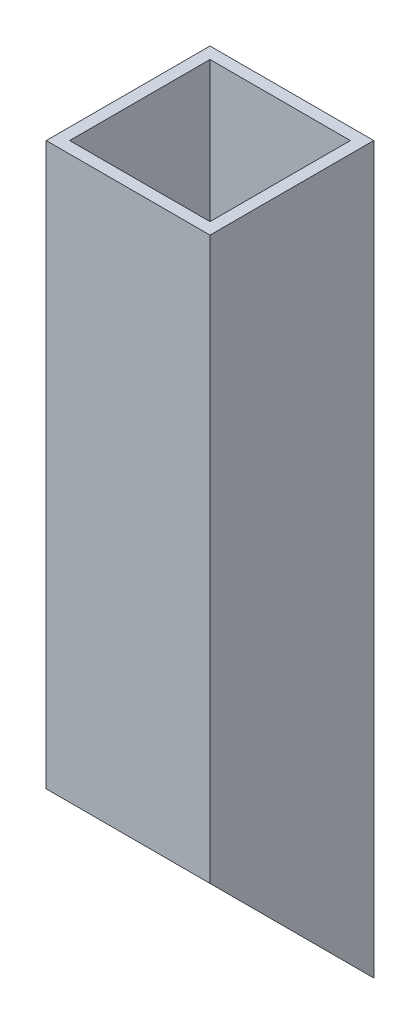
ISO-10303-21;
HEADER;
FILE_DESCRIPTION(('STEP AP214'),'2;1');
FILE_NAME('part.step','',(''),(''),'','','');
FILE_SCHEMA(('AUTOMOTIVE_DESIGN { 1 0 10303 214 1 1 1 1 }'));
ENDSEC;
DATA;
#1=APPLICATION_CONTEXT('core data for automotive mechanical design processes');
#2=APPLICATION_PROTOCOL_DEFINITION('international standard','automotive_design',2000,#1);
#3=PRODUCT_CONTEXT('',#1,'mechanical');
#4=PRODUCT('Part','Part','',(#3));
#5=PRODUCT_RELATED_PRODUCT_CATEGORY('part','',(#4));
#6=PRODUCT_DEFINITION_FORMATION('','',#4);
#7=PRODUCT_DEFINITION_CONTEXT('part definition',#1,'design');
#8=PRODUCT_DEFINITION('design','',#6,#7);
#9=PRODUCT_DEFINITION_SHAPE('','',#8);
#10=(LENGTH_UNIT() NAMED_UNIT(*) SI_UNIT(.MILLI.,.METRE.));
#11=(NAMED_UNIT(*) PLANE_ANGLE_UNIT() SI_UNIT($,.RADIAN.));
#12=(NAMED_UNIT(*) SI_UNIT($,.STERADIAN.) SOLID_ANGLE_UNIT());
#13=UNCERTAINTY_MEASURE_WITH_UNIT(LENGTH_MEASURE(1.E-05),#10,'distance_accuracy_value','');
#14=(GEOMETRIC_REPRESENTATION_CONTEXT(3) GLOBAL_UNCERTAINTY_ASSIGNED_CONTEXT((#13)) GLOBAL_UNIT_ASSIGNED_CONTEXT((#10,
#11,#12)) REPRESENTATION_CONTEXT('',''));
#15=CARTESIAN_POINT('',(0.,0.,0.));
#16=DIRECTION('',(0.,0.,1.));
#17=DIRECTION('',(1.,0.,0.));
#18=AXIS2_PLACEMENT_3D('',#15,#16,#17);
#19=CARTESIAN_POINT('',(0.,196.85,0.));
#20=DIRECTION('',(0.,-1.,0.));
#21=DIRECTION('',(0.,0.,-1.));
#22=AXIS2_PLACEMENT_3D('',#19,#20,#21);
#23=PLANE('',#22);
#24=DIRECTION('',(0.,0.,1.));
#25=VECTOR('',#24,1.);
#26=CARTESIAN_POINT('',(0.,196.85,0.));
#27=LINE('',#26,#25);
#28=CARTESIAN_POINT('',(0.,196.85,-44.45));
#29=VERTEX_POINT('',#28);
#30=CARTESIAN_POINT('',(0.,196.85,0.));
#31=VERTEX_POINT('',#30);
#32=EDGE_CURVE('E120',#29,#31,#27,.T.);
#33=ORIENTED_EDGE('',*,*,#32,.T.);
#34=DIRECTION('',(1.,0.,0.));
#35=VECTOR('',#34,1.);
#36=CARTESIAN_POINT('',(0.,196.85,0.));
#37=LINE('',#36,#35);
#38=CARTESIAN_POINT('',(44.45,196.85,0.));
#39=VERTEX_POINT('',#38);
#40=EDGE_CURVE('E126',#31,#39,#37,.T.);
#41=ORIENTED_EDGE('',*,*,#40,.T.);
#42=DIRECTION('',(0.,0.,-1.));
#43=VECTOR('',#42,1.);
#44=CARTESIAN_POINT('',(44.45,196.85,0.));
#45=LINE('',#44,#43);
#46=CARTESIAN_POINT('',(44.45,196.85,-44.45));
#47=VERTEX_POINT('',#46);
#48=EDGE_CURVE('E123',#39,#47,#45,.T.);
#49=ORIENTED_EDGE('',*,*,#48,.T.);
#50=DIRECTION('',(-1.,0.,0.));
#51=VECTOR('',#50,1.);
#52=CARTESIAN_POINT('',(0.,196.85,-44.45));
#53=LINE('',#52,#51);
#54=EDGE_CURVE('E117',#47,#29,#53,.T.);
#55=ORIENTED_EDGE('',*,*,#54,.T.);
#56=EDGE_LOOP('',(#33,#41,#49,#55));
#57=FACE_BOUND('',#56,.T.);
#58=DIRECTION('',(1.,0.,0.));
#59=VECTOR('',#58,1.);
#60=CARTESIAN_POINT('',(3.175,196.85,-3.175));
#61=LINE('',#60,#59);
#62=CARTESIAN_POINT('',(3.175,196.85,-3.175));
#63=VERTEX_POINT('',#62);
#64=CARTESIAN_POINT('',(41.275,196.85,-3.175));
#65=VERTEX_POINT('',#64);
#66=EDGE_CURVE('E88',#63,#65,#61,.T.);
#67=ORIENTED_EDGE('',*,*,#66,.F.);
#68=DIRECTION('',(0.,0.,1.));
#69=VECTOR('',#68,1.);
#70=CARTESIAN_POINT('',(3.175,196.85,-3.175));
#71=LINE('',#70,#69);
#72=CARTESIAN_POINT('',(3.175,196.85,-41.275));
#73=VERTEX_POINT('',#72);
#74=EDGE_CURVE('E136',#73,#63,#71,.T.);
#75=ORIENTED_EDGE('',*,*,#74,.F.);
#76=DIRECTION('',(-1.,0.,0.));
#77=VECTOR('',#76,1.);
#78=CARTESIAN_POINT('',(3.175,196.85,-41.275));
#79=LINE('',#78,#77);
#80=CARTESIAN_POINT('',(41.275,196.85,-41.275));
#81=VERTEX_POINT('',#80);
#82=EDGE_CURVE('E139',#81,#73,#79,.T.);
#83=ORIENTED_EDGE('',*,*,#82,.F.);
#84=DIRECTION('',(0.,0.,-1.));
#85=VECTOR('',#84,1.);
#86=CARTESIAN_POINT('',(41.275,196.85,-3.175));
#87=LINE('',#86,#85);
#88=EDGE_CURVE('E98',#65,#81,#87,.T.);
#89=ORIENTED_EDGE('',*,*,#88,.F.);
#90=EDGE_LOOP('',(#67,#75,#83,#89));
#91=FACE_BOUND('',#90,.T.);
#92=ADVANCED_FACE('F33',(#57,#91),#23,.F.);
#93=CARTESIAN_POINT('',(0.,196.85,0.));
#94=DIRECTION('',(1.,0.,0.));
#95=DIRECTION('',(0.,0.,-1.));
#96=AXIS2_PLACEMENT_3D('',#93,#94,#95);
#97=PLANE('',#96);
#98=DIRECTION('',(0.,-1.,0.));
#99=VECTOR('',#98,1.);
#100=CARTESIAN_POINT('',(0.,196.85,-44.45));
#101=LINE('',#100,#99);
#102=CARTESIAN_POINT('',(0.,0.,-44.45));
#103=VERTEX_POINT('',#102);
#104=EDGE_CURVE('E115',#29,#103,#101,.T.);
#105=ORIENTED_EDGE('',*,*,#104,.T.);
#106=DIRECTION('',(0.,0.707106781186546,0.707106781186549));
#107=VECTOR('',#106,1.);
#108=CARTESIAN_POINT('',(0.,44.45,0.));
#109=LINE('',#108,#107);
#110=CARTESIAN_POINT('',(0.,44.45,0.));
#111=VERTEX_POINT('',#110);
#112=EDGE_CURVE('E11',#103,#111,#109,.T.);
#113=ORIENTED_EDGE('',*,*,#112,.T.);
#114=DIRECTION('',(0.,-1.,0.));
#115=VECTOR('',#114,1.);
#116=CARTESIAN_POINT('',(0.,196.85,0.));
#117=LINE('',#116,#115);
#118=EDGE_CURVE('E107',#31,#111,#117,.T.);
#119=ORIENTED_EDGE('',*,*,#118,.F.);
#120=ORIENTED_EDGE('',*,*,#32,.F.);
#121=EDGE_LOOP('',(#105,#113,#119,#120));
#122=FACE_BOUND('',#121,.T.);
#123=ADVANCED_FACE('F173',(#122),#97,.F.);
#124=CARTESIAN_POINT('',(0.,196.85,0.));
#125=DIRECTION('',(0.,0.,-1.));
#126=DIRECTION('',(-1.,0.,0.));
#127=AXIS2_PLACEMENT_3D('',#124,#125,#126);
#128=PLANE('',#127);
#129=ORIENTED_EDGE('',*,*,#118,.T.);
#130=DIRECTION('',(1.,0.,0.));
#131=VECTOR('',#130,1.);
#132=CARTESIAN_POINT('',(44.45,44.45,0.));
#133=LINE('',#132,#131);
#134=CARTESIAN_POINT('',(44.45,44.45,0.));
#135=VERTEX_POINT('',#134);
#136=EDGE_CURVE('E104',#111,#135,#133,.T.);
#137=ORIENTED_EDGE('',*,*,#136,.T.);
#138=DIRECTION('',(0.,-1.,0.));
#139=VECTOR('',#138,1.);
#140=CARTESIAN_POINT('',(44.45,196.85,0.));
#141=LINE('',#140,#139);
#142=EDGE_CURVE('E109',#39,#135,#141,.T.);
#143=ORIENTED_EDGE('',*,*,#142,.F.);
#144=ORIENTED_EDGE('',*,*,#40,.F.);
#145=EDGE_LOOP('',(#129,#137,#143,#144));
#146=FACE_BOUND('',#145,.T.);
#147=ADVANCED_FACE('F177',(#146),#128,.F.);
#148=CARTESIAN_POINT('',(44.45,196.85,0.));
#149=DIRECTION('',(-1.,0.,0.));
#150=DIRECTION('',(0.,0.,1.));
#151=AXIS2_PLACEMENT_3D('',#148,#149,#150);
#152=PLANE('',#151);
#153=ORIENTED_EDGE('',*,*,#142,.T.);
#154=DIRECTION('',(0.,-0.707106781186546,-0.707106781186549));
#155=VECTOR('',#154,1.);
#156=CARTESIAN_POINT('',(44.45,44.45,0.));
#157=LINE('',#156,#155);
#158=CARTESIAN_POINT('',(44.45,0.,-44.45));
#159=VERTEX_POINT('',#158);
#160=EDGE_CURVE('E43',#135,#159,#157,.T.);
#161=ORIENTED_EDGE('',*,*,#160,.T.);
#162=DIRECTION('',(0.,-1.,0.));
#163=VECTOR('',#162,1.);
#164=CARTESIAN_POINT('',(44.45,196.85,-44.45));
#165=LINE('',#164,#163);
#166=EDGE_CURVE('E112',#47,#159,#165,.T.);
#167=ORIENTED_EDGE('',*,*,#166,.F.);
#168=ORIENTED_EDGE('',*,*,#48,.F.);
#169=EDGE_LOOP('',(#153,#161,#167,#168));
#170=FACE_BOUND('',#169,.T.);
#171=ADVANCED_FACE('F180',(#170),#152,.F.);
#172=CARTESIAN_POINT('',(0.,196.85,-44.45));
#173=DIRECTION('',(0.,0.,1.));
#174=DIRECTION('',(1.,0.,0.));
#175=AXIS2_PLACEMENT_3D('',#172,#173,#174);
#176=PLANE('',#175);
#177=DIRECTION('',(-1.,0.,0.));
#178=VECTOR('',#177,1.);
#179=CARTESIAN_POINT('',(0.,0.,-44.45));
#180=LINE('',#179,#178);
#181=EDGE_CURVE('E89',#159,#103,#180,.T.);
#182=ORIENTED_EDGE('',*,*,#181,.T.);
#183=ORIENTED_EDGE('',*,*,#104,.F.);
#184=ORIENTED_EDGE('',*,*,#54,.F.);
#185=ORIENTED_EDGE('',*,*,#166,.T.);
#186=EDGE_LOOP('',(#182,#183,#184,#185));
#187=FACE_BOUND('',#186,.T.);
#188=ADVANCED_FACE('F168',(#187),#176,.F.);
#189=CARTESIAN_POINT('',(3.175,196.85,-3.175));
#190=DIRECTION('',(0.,0.,-1.));
#191=DIRECTION('',(-1.,0.,0.));
#192=AXIS2_PLACEMENT_3D('',#189,#190,#191);
#193=PLANE('',#192);
#194=DIRECTION('',(1.,0.,0.));
#195=VECTOR('',#194,1.);
#196=CARTESIAN_POINT('',(0.,41.275,-3.175));
#197=LINE('',#196,#195);
#198=CARTESIAN_POINT('',(3.175,41.275,-3.175));
#199=VERTEX_POINT('',#198);
#200=CARTESIAN_POINT('',(41.275,41.275,-3.175));
#201=VERTEX_POINT('',#200);
#202=EDGE_CURVE('E37',#199,#201,#197,.T.);
#203=ORIENTED_EDGE('',*,*,#202,.F.);
#204=DIRECTION('',(0.,-1.,0.));
#205=VECTOR('',#204,1.);
#206=CARTESIAN_POINT('',(3.175,196.85,-3.175));
#207=LINE('',#206,#205);
#208=EDGE_CURVE('E134',#63,#199,#207,.T.);
#209=ORIENTED_EDGE('',*,*,#208,.F.);
#210=ORIENTED_EDGE('',*,*,#66,.T.);
#211=DIRECTION('',(0.,-1.,0.));
#212=VECTOR('',#211,1.);
#213=CARTESIAN_POINT('',(41.275,196.85,-3.175));
#214=LINE('',#213,#212);
#215=EDGE_CURVE('E72',#65,#201,#214,.T.);
#216=ORIENTED_EDGE('',*,*,#215,.T.);
#217=EDGE_LOOP('',(#203,#209,#210,#216));
#218=FACE_BOUND('',#217,.T.);
#219=ADVANCED_FACE('F84',(#218),#193,.T.);
#220=CARTESIAN_POINT('',(41.275,196.85,-3.175));
#221=DIRECTION('',(-1.,0.,0.));
#222=DIRECTION('',(0.,0.,1.));
#223=AXIS2_PLACEMENT_3D('',#220,#221,#222);
#224=PLANE('',#223);
#225=DIRECTION('',(0.,-0.707106781186546,-0.707106781186549));
#226=VECTOR('',#225,1.);
#227=CARTESIAN_POINT('',(41.275,44.45,0.));
#228=LINE('',#227,#226);
#229=CARTESIAN_POINT('',(41.275,3.17500000000018,-41.275));
#230=VERTEX_POINT('',#229);
#231=EDGE_CURVE('E68',#201,#230,#228,.T.);
#232=ORIENTED_EDGE('',*,*,#231,.F.);
#233=ORIENTED_EDGE('',*,*,#215,.F.);
#234=ORIENTED_EDGE('',*,*,#88,.T.);
#235=DIRECTION('',(0.,-1.,0.));
#236=VECTOR('',#235,1.);
#237=CARTESIAN_POINT('',(41.275,196.85,-41.275));
#238=LINE('',#237,#236);
#239=EDGE_CURVE('E75',#81,#230,#238,.T.);
#240=ORIENTED_EDGE('',*,*,#239,.T.);
#241=EDGE_LOOP('',(#232,#233,#234,#240));
#242=FACE_BOUND('',#241,.T.);
#243=ADVANCED_FACE('F70',(#242),#224,.T.);
#244=CARTESIAN_POINT('',(3.175,196.85,-41.275));
#245=DIRECTION('',(0.,0.,1.));
#246=DIRECTION('',(1.,0.,0.));
#247=AXIS2_PLACEMENT_3D('',#244,#245,#246);
#248=PLANE('',#247);
#249=DIRECTION('',(-1.,0.,0.));
#250=VECTOR('',#249,1.);
#251=CARTESIAN_POINT('',(0.,3.17500000000015,-41.275));
#252=LINE('',#251,#250);
#253=CARTESIAN_POINT('',(3.175,3.17500000000018,-41.275));
#254=VERTEX_POINT('',#253);
#255=EDGE_CURVE('E80',#230,#254,#252,.T.);
#256=ORIENTED_EDGE('',*,*,#255,.F.);
#257=ORIENTED_EDGE('',*,*,#239,.F.);
#258=ORIENTED_EDGE('',*,*,#82,.T.);
#259=DIRECTION('',(0.,-1.,0.));
#260=VECTOR('',#259,1.);
#261=CARTESIAN_POINT('',(3.175,196.85,-41.275));
#262=LINE('',#261,#260);
#263=EDGE_CURVE('E132',#73,#254,#262,.T.);
#264=ORIENTED_EDGE('',*,*,#263,.T.);
#265=EDGE_LOOP('',(#256,#257,#258,#264));
#266=FACE_BOUND('',#265,.T.);
#267=ADVANCED_FACE('F148',(#266),#248,.T.);
#268=CARTESIAN_POINT('',(3.175,196.85,-3.175));
#269=DIRECTION('',(1.,0.,0.));
#270=DIRECTION('',(0.,0.,-1.));
#271=AXIS2_PLACEMENT_3D('',#268,#269,#270);
#272=PLANE('',#271);
#273=DIRECTION('',(0.,0.707106781186546,0.707106781186549));
#274=VECTOR('',#273,1.);
#275=CARTESIAN_POINT('',(3.175,44.45,0.));
#276=LINE('',#275,#274);
#277=EDGE_CURVE('E93',#254,#199,#276,.T.);
#278=ORIENTED_EDGE('',*,*,#277,.F.);
#279=ORIENTED_EDGE('',*,*,#263,.F.);
#280=ORIENTED_EDGE('',*,*,#74,.T.);
#281=ORIENTED_EDGE('',*,*,#208,.T.);
#282=EDGE_LOOP('',(#278,#279,#280,#281));
#283=FACE_BOUND('',#282,.T.);
#284=ADVANCED_FACE('F150',(#283),#272,.T.);
#285=CARTESIAN_POINT('',(0.,44.45,0.));
#286=DIRECTION('',(0.,-0.707106781186549,0.707106781186546));
#287=DIRECTION('',(-1.,0.,0.));
#288=AXIS2_PLACEMENT_3D('',#285,#286,#287);
#289=PLANE('',#288);
#290=ORIENTED_EDGE('',*,*,#112,.F.);
#291=ORIENTED_EDGE('',*,*,#181,.F.);
#292=ORIENTED_EDGE('',*,*,#160,.F.);
#293=ORIENTED_EDGE('',*,*,#136,.F.);
#294=EDGE_LOOP('',(#290,#291,#292,#293));
#295=FACE_BOUND('',#294,.T.);
#296=ORIENTED_EDGE('',*,*,#277,.T.);
#297=ORIENTED_EDGE('',*,*,#202,.T.);
#298=ORIENTED_EDGE('',*,*,#231,.T.);
#299=ORIENTED_EDGE('',*,*,#255,.T.);
#300=EDGE_LOOP('',(#296,#297,#298,#299));
#301=FACE_BOUND('',#300,.T.);
#302=ADVANCED_FACE('F35',(#295,#301),#289,.T.);
#303=CLOSED_SHELL('',(#92,#123,#147,#171,#188,#219,#243,#267,#284,#302));
#304=MANIFOLD_SOLID_BREP('B2',#303);
#305=ADVANCED_BREP_SHAPE_REPRESENTATION('',(#18,#304),#14);
#306=SHAPE_DEFINITION_REPRESENTATION(#9,#305);
ENDSEC;
END-ISO-10303-21;
